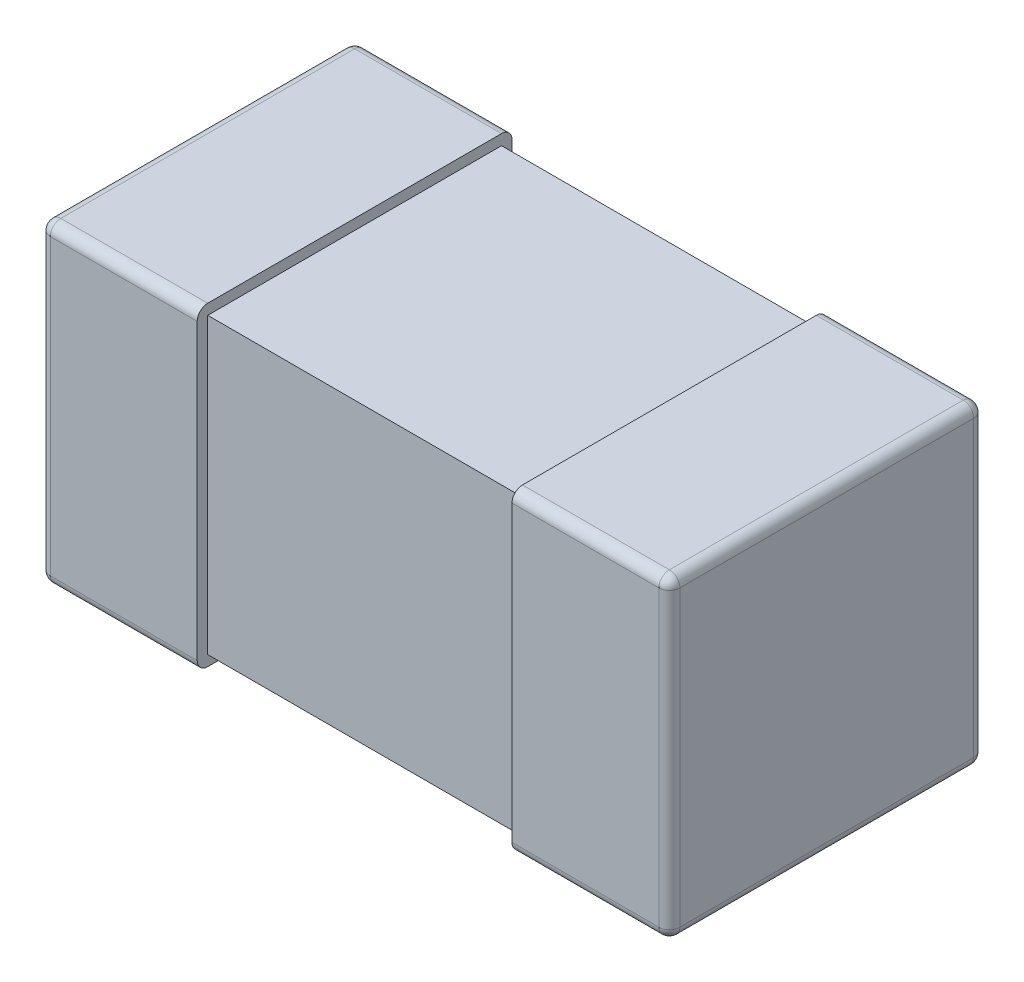
ISO-10303-21;
HEADER;
FILE_DESCRIPTION(('STEP AP214'),'2;1');
FILE_NAME('part.step','',(''),(''),'','','');
FILE_SCHEMA(('AUTOMOTIVE_DESIGN { 1 0 10303 214 1 1 1 1 }'));
ENDSEC;
DATA;
#1=APPLICATION_CONTEXT('core data for automotive mechanical design processes');
#2=APPLICATION_PROTOCOL_DEFINITION('international standard','automotive_design',2000,#1);
#3=PRODUCT_CONTEXT('',#1,'mechanical');
#4=PRODUCT('Part','Part','',(#3));
#5=PRODUCT_RELATED_PRODUCT_CATEGORY('part','',(#4));
#6=PRODUCT_DEFINITION_FORMATION('','',#4);
#7=PRODUCT_DEFINITION_CONTEXT('part definition',#1,'design');
#8=PRODUCT_DEFINITION('design','',#6,#7);
#9=PRODUCT_DEFINITION_SHAPE('','',#8);
#10=(LENGTH_UNIT() NAMED_UNIT(*) SI_UNIT(.MILLI.,.METRE.));
#11=(NAMED_UNIT(*) PLANE_ANGLE_UNIT() SI_UNIT($,.RADIAN.));
#12=(NAMED_UNIT(*) SI_UNIT($,.STERADIAN.) SOLID_ANGLE_UNIT());
#13=UNCERTAINTY_MEASURE_WITH_UNIT(LENGTH_MEASURE(1.E-05),#10,'distance_accuracy_value','');
#14=(GEOMETRIC_REPRESENTATION_CONTEXT(3) GLOBAL_UNCERTAINTY_ASSIGNED_CONTEXT((#13)) GLOBAL_UNIT_ASSIGNED_CONTEXT((#10,
#11,#12)) REPRESENTATION_CONTEXT('',''));
#15=CARTESIAN_POINT('',(0.,0.,0.));
#16=DIRECTION('',(0.,0.,1.));
#17=DIRECTION('',(1.,0.,0.));
#18=AXIS2_PLACEMENT_3D('',#15,#16,#17);
#19=CARTESIAN_POINT('',(-0.3,0.15,-0.15));
#20=DIRECTION('',(1.,0.,0.));
#21=DIRECTION('',(0.,0.,-1.));
#22=AXIS2_PLACEMENT_3D('',#19,#20,#21);
#23=PLANE('',#22);
#24=DIRECTION('',(0.,-1.,0.));
#25=VECTOR('',#24,1.);
#26=CARTESIAN_POINT('',(-0.3,0.15,-0.14));
#27=LINE('',#26,#25);
#28=CARTESIAN_POINT('',(-0.3,0.14,-0.14));
#29=VERTEX_POINT('',#28);
#30=CARTESIAN_POINT('',(-0.3,-0.14,-0.14));
#31=VERTEX_POINT('',#30);
#32=EDGE_CURVE('E349',#29,#31,#27,.T.);
#33=ORIENTED_EDGE('',*,*,#32,.T.);
#34=DIRECTION('',(0.,0.,1.));
#35=VECTOR('',#34,1.);
#36=CARTESIAN_POINT('',(-0.3,-0.14,-0.15));
#37=LINE('',#36,#35);
#38=CARTESIAN_POINT('',(-0.3,-0.14,0.14));
#39=VERTEX_POINT('',#38);
#40=EDGE_CURVE('E351',#31,#39,#37,.T.);
#41=ORIENTED_EDGE('',*,*,#40,.T.);
#42=DIRECTION('',(0.,-1.,0.));
#43=VECTOR('',#42,1.);
#44=CARTESIAN_POINT('',(-0.3,0.15,0.14));
#45=LINE('',#44,#43);
#46=CARTESIAN_POINT('',(-0.3,0.14,0.14));
#47=VERTEX_POINT('',#46);
#48=EDGE_CURVE('E347',#39,#47,#45,.F.);
#49=ORIENTED_EDGE('',*,*,#48,.T.);
#50=DIRECTION('',(0.,0.,1.));
#51=VECTOR('',#50,1.);
#52=CARTESIAN_POINT('',(-0.3,0.14,-0.15));
#53=LINE('',#52,#51);
#54=EDGE_CURVE('E345',#47,#29,#53,.F.);
#55=ORIENTED_EDGE('',*,*,#54,.T.);
#56=EDGE_LOOP('',(#33,#41,#49,#55));
#57=FACE_BOUND('',#56,.T.);
#58=ADVANCED_FACE('F34',(#57),#23,.F.);
#59=CARTESIAN_POINT('',(-0.3,0.15,0.15));
#60=DIRECTION('',(0.,0.,-1.));
#61=DIRECTION('',(-1.,0.,0.));
#62=AXIS2_PLACEMENT_3D('',#59,#60,#61);
#63=PLANE('',#62);
#64=DIRECTION('',(0.,-1.,0.));
#65=VECTOR('',#64,1.);
#66=CARTESIAN_POINT('',(-0.29,0.15,0.15));
#67=LINE('',#66,#65);
#68=CARTESIAN_POINT('',(-0.29,0.14,0.15));
#69=VERTEX_POINT('',#68);
#70=CARTESIAN_POINT('',(-0.29,-0.14,0.15));
#71=VERTEX_POINT('',#70);
#72=EDGE_CURVE('E377',#69,#71,#67,.T.);
#73=ORIENTED_EDGE('',*,*,#72,.T.);
#74=DIRECTION('',(1.,0.,0.));
#75=VECTOR('',#74,1.);
#76=CARTESIAN_POINT('',(-0.3,-0.14,0.15));
#77=LINE('',#76,#75);
#78=CARTESIAN_POINT('',(-0.15,-0.14,0.15));
#79=VERTEX_POINT('',#78);
#80=EDGE_CURVE('E379',#71,#79,#77,.T.);
#81=ORIENTED_EDGE('',*,*,#80,.T.);
#82=DIRECTION('',(0.,-1.,0.));
#83=VECTOR('',#82,1.);
#84=CARTESIAN_POINT('',(-0.15,0.15,0.15));
#85=LINE('',#84,#83);
#86=CARTESIAN_POINT('',(-0.15,0.14,0.15));
#87=VERTEX_POINT('',#86);
#88=EDGE_CURVE('E342',#87,#79,#85,.T.);
#89=ORIENTED_EDGE('',*,*,#88,.F.);
#90=DIRECTION('',(1.,0.,0.));
#91=VECTOR('',#90,1.);
#92=CARTESIAN_POINT('',(-0.3,0.14,0.15));
#93=LINE('',#92,#91);
#94=EDGE_CURVE('E375',#87,#69,#93,.F.);
#95=ORIENTED_EDGE('',*,*,#94,.T.);
#96=EDGE_LOOP('',(#73,#81,#89,#95));
#97=FACE_BOUND('',#96,.T.);
#98=ADVANCED_FACE('F448',(#97),#63,.F.);
#99=CARTESIAN_POINT('',(-0.15,0.15,-0.15));
#100=DIRECTION('',(-1.,0.,0.));
#101=DIRECTION('',(0.,0.,1.));
#102=AXIS2_PLACEMENT_3D('',#99,#100,#101);
#103=PLANE('',#102);
#104=DIRECTION('',(0.,1.,0.));
#105=VECTOR('',#104,1.);
#106=CARTESIAN_POINT('',(-0.15,0.14,-0.14));
#107=LINE('',#106,#105);
#108=CARTESIAN_POINT('',(-0.15,-0.14,-0.14));
#109=VERTEX_POINT('',#108);
#110=CARTESIAN_POINT('',(-0.15,0.14,-0.14));
#111=VERTEX_POINT('',#110);
#112=EDGE_CURVE('E208',#109,#111,#107,.T.);
#113=ORIENTED_EDGE('',*,*,#112,.F.);
#114=DIRECTION('',(0.,0.,-1.));
#115=VECTOR('',#114,1.);
#116=CARTESIAN_POINT('',(-0.15,-0.14,0.14));
#117=LINE('',#116,#115);
#118=CARTESIAN_POINT('',(-0.15,-0.14,0.14));
#119=VERTEX_POINT('',#118);
#120=EDGE_CURVE('E203',#119,#109,#117,.T.);
#121=ORIENTED_EDGE('',*,*,#120,.F.);
#122=DIRECTION('',(0.,-1.,0.));
#123=VECTOR('',#122,1.);
#124=CARTESIAN_POINT('',(-0.15,0.14,0.14));
#125=LINE('',#124,#123);
#126=CARTESIAN_POINT('',(-0.15,0.14,0.14));
#127=VERTEX_POINT('',#126);
#128=EDGE_CURVE('E324',#127,#119,#125,.T.);
#129=ORIENTED_EDGE('',*,*,#128,.F.);
#130=DIRECTION('',(0.,0.,1.));
#131=VECTOR('',#130,1.);
#132=CARTESIAN_POINT('',(-0.15,0.14,0.14));
#133=LINE('',#132,#131);
#134=EDGE_CURVE('E51',#111,#127,#133,.T.);
#135=ORIENTED_EDGE('',*,*,#134,.F.);
#136=EDGE_LOOP('',(#113,#121,#129,#135));
#137=FACE_BOUND('',#136,.T.);
#138=DIRECTION('',(0.,0.,-1.));
#139=VECTOR('',#138,1.);
#140=CARTESIAN_POINT('',(-0.15,-0.15,-0.15));
#141=LINE('',#140,#139);
#142=CARTESIAN_POINT('',(-0.15,-0.15,0.14));
#143=VERTEX_POINT('',#142);
#144=CARTESIAN_POINT('',(-0.15,-0.15,-0.14));
#145=VERTEX_POINT('',#144);
#146=EDGE_CURVE('E337',#143,#145,#141,.T.);
#147=ORIENTED_EDGE('',*,*,#146,.T.);
#148=CARTESIAN_POINT('',(-0.15,-0.14,-0.14));
#149=DIRECTION('',(-1.,0.,0.));
#150=DIRECTION('',(0.,0.,1.));
#151=AXIS2_PLACEMENT_3D('',#148,#149,#150);
#152=CIRCLE('',#151,0.01);
#153=CARTESIAN_POINT('',(-0.15,-0.14,-0.15));
#154=VERTEX_POINT('',#153);
#155=EDGE_CURVE('E373',#145,#154,#152,.F.);
#156=ORIENTED_EDGE('',*,*,#155,.T.);
#157=DIRECTION('',(0.,-1.,0.));
#158=VECTOR('',#157,1.);
#159=CARTESIAN_POINT('',(-0.15,0.15,-0.15));
#160=LINE('',#159,#158);
#161=CARTESIAN_POINT('',(-0.15,0.14,-0.15));
#162=VERTEX_POINT('',#161);
#163=EDGE_CURVE('E336',#162,#154,#160,.T.);
#164=ORIENTED_EDGE('',*,*,#163,.F.);
#165=CARTESIAN_POINT('',(-0.15,0.14,-0.14));
#166=DIRECTION('',(-1.,0.,0.));
#167=DIRECTION('',(0.,0.,1.));
#168=AXIS2_PLACEMENT_3D('',#165,#166,#167);
#169=CIRCLE('',#168,0.01);
#170=CARTESIAN_POINT('',(-0.15,0.15,-0.14));
#171=VERTEX_POINT('',#170);
#172=EDGE_CURVE('E369',#162,#171,#169,.F.);
#173=ORIENTED_EDGE('',*,*,#172,.T.);
#174=DIRECTION('',(0.,0.,-1.));
#175=VECTOR('',#174,1.);
#176=CARTESIAN_POINT('',(-0.15,0.15,-0.15));
#177=LINE('',#176,#175);
#178=CARTESIAN_POINT('',(-0.15,0.15,0.14));
#179=VERTEX_POINT('',#178);
#180=EDGE_CURVE('E334',#179,#171,#177,.T.);
#181=ORIENTED_EDGE('',*,*,#180,.F.);
#182=CARTESIAN_POINT('',(-0.15,0.14,0.14));
#183=DIRECTION('',(-1.,0.,0.));
#184=DIRECTION('',(0.,0.,1.));
#185=AXIS2_PLACEMENT_3D('',#182,#183,#184);
#186=CIRCLE('',#185,0.01);
#187=EDGE_CURVE('E367',#179,#87,#186,.F.);
#188=ORIENTED_EDGE('',*,*,#187,.T.);
#189=ORIENTED_EDGE('',*,*,#88,.T.);
#190=CARTESIAN_POINT('',(-0.15,-0.14,0.14));
#191=DIRECTION('',(-1.,0.,0.));
#192=DIRECTION('',(0.,0.,1.));
#193=AXIS2_PLACEMENT_3D('',#190,#191,#192);
#194=CIRCLE('',#193,0.01);
#195=EDGE_CURVE('E371',#79,#143,#194,.F.);
#196=ORIENTED_EDGE('',*,*,#195,.T.);
#197=EDGE_LOOP('',(#147,#156,#164,#173,#181,#188,#189,#196));
#198=FACE_BOUND('',#197,.T.);
#199=ADVANCED_FACE('F445',(#137,#198),#103,.F.);
#200=CARTESIAN_POINT('',(-0.3,0.15,-0.15));
#201=DIRECTION('',(0.,0.,1.));
#202=DIRECTION('',(1.,0.,0.));
#203=AXIS2_PLACEMENT_3D('',#200,#201,#202);
#204=PLANE('',#203);
#205=ORIENTED_EDGE('',*,*,#163,.T.);
#206=DIRECTION('',(-1.,0.,0.));
#207=VECTOR('',#206,1.);
#208=CARTESIAN_POINT('',(-0.3,-0.14,-0.15));
#209=LINE('',#208,#207);
#210=CARTESIAN_POINT('',(-0.29,-0.14,-0.15));
#211=VERTEX_POINT('',#210);
#212=EDGE_CURVE('E365',#154,#211,#209,.T.);
#213=ORIENTED_EDGE('',*,*,#212,.T.);
#214=DIRECTION('',(0.,-1.,0.));
#215=VECTOR('',#214,1.);
#216=CARTESIAN_POINT('',(-0.29,0.15,-0.15));
#217=LINE('',#216,#215);
#218=CARTESIAN_POINT('',(-0.29,0.14,-0.15));
#219=VERTEX_POINT('',#218);
#220=EDGE_CURVE('E363',#211,#219,#217,.F.);
#221=ORIENTED_EDGE('',*,*,#220,.T.);
#222=DIRECTION('',(-1.,0.,0.));
#223=VECTOR('',#222,1.);
#224=CARTESIAN_POINT('',(-0.15,0.14,-0.15));
#225=LINE('',#224,#223);
#226=EDGE_CURVE('E361',#219,#162,#225,.F.);
#227=ORIENTED_EDGE('',*,*,#226,.T.);
#228=EDGE_LOOP('',(#205,#213,#221,#227));
#229=FACE_BOUND('',#228,.T.);
#230=ADVANCED_FACE('F474',(#229),#204,.F.);
#231=CARTESIAN_POINT('',(-0.3,0.15,0.15));
#232=DIRECTION('',(0.,1.,0.));
#233=DIRECTION('',(0.,0.,1.));
#234=AXIS2_PLACEMENT_3D('',#231,#232,#233);
#235=PLANE('',#234);
#236=ORIENTED_EDGE('',*,*,#180,.T.);
#237=DIRECTION('',(-1.,0.,0.));
#238=VECTOR('',#237,1.);
#239=CARTESIAN_POINT('',(-0.3,0.15,-0.14));
#240=LINE('',#239,#238);
#241=CARTESIAN_POINT('',(-0.29,0.15,-0.14));
#242=VERTEX_POINT('',#241);
#243=EDGE_CURVE('E11',#171,#242,#240,.T.);
#244=ORIENTED_EDGE('',*,*,#243,.T.);
#245=DIRECTION('',(0.,0.,1.));
#246=VECTOR('',#245,1.);
#247=CARTESIAN_POINT('',(-0.29,0.15,0.15));
#248=LINE('',#247,#246);
#249=CARTESIAN_POINT('',(-0.29,0.15,0.14));
#250=VERTEX_POINT('',#249);
#251=EDGE_CURVE('E43',#242,#250,#248,.T.);
#252=ORIENTED_EDGE('',*,*,#251,.T.);
#253=DIRECTION('',(1.,0.,0.));
#254=VECTOR('',#253,1.);
#255=CARTESIAN_POINT('',(-0.15,0.15,0.14));
#256=LINE('',#255,#254);
#257=EDGE_CURVE('E381',#250,#179,#256,.T.);
#258=ORIENTED_EDGE('',*,*,#257,.T.);
#259=EDGE_LOOP('',(#236,#244,#252,#258));
#260=FACE_BOUND('',#259,.T.);
#261=ADVANCED_FACE('F435',(#260),#235,.T.);
#262=CARTESIAN_POINT('',(-0.3,-0.15,0.15));
#263=DIRECTION('',(0.,1.,0.));
#264=DIRECTION('',(0.,0.,1.));
#265=AXIS2_PLACEMENT_3D('',#262,#263,#264);
#266=PLANE('',#265);
#267=DIRECTION('',(0.,0.,1.));
#268=VECTOR('',#267,1.);
#269=CARTESIAN_POINT('',(-0.29,-0.15,0.15));
#270=LINE('',#269,#268);
#271=CARTESIAN_POINT('',(-0.29,-0.15,0.14));
#272=VERTEX_POINT('',#271);
#273=CARTESIAN_POINT('',(-0.29,-0.15,-0.14));
#274=VERTEX_POINT('',#273);
#275=EDGE_CURVE('E356',#272,#274,#270,.F.);
#276=ORIENTED_EDGE('',*,*,#275,.T.);
#277=DIRECTION('',(-1.,0.,0.));
#278=VECTOR('',#277,1.);
#279=CARTESIAN_POINT('',(-0.3,-0.15,-0.14));
#280=LINE('',#279,#278);
#281=EDGE_CURVE('E359',#274,#145,#280,.F.);
#282=ORIENTED_EDGE('',*,*,#281,.T.);
#283=ORIENTED_EDGE('',*,*,#146,.F.);
#284=DIRECTION('',(1.,0.,0.));
#285=VECTOR('',#284,1.);
#286=CARTESIAN_POINT('',(-0.3,-0.15,0.14));
#287=LINE('',#286,#285);
#288=EDGE_CURVE('E354',#143,#272,#287,.F.);
#289=ORIENTED_EDGE('',*,*,#288,.T.);
#290=EDGE_LOOP('',(#276,#282,#283,#289));
#291=FACE_BOUND('',#290,.T.);
#292=ADVANCED_FACE('F465',(#291),#266,.F.);
#293=CARTESIAN_POINT('',(-0.3,0.14,-0.14));
#294=DIRECTION('',(1.,0.,0.));
#295=DIRECTION('',(0.,0.,-1.));
#296=AXIS2_PLACEMENT_3D('',#293,#294,#295);
#297=CYLINDRICAL_SURFACE('',#296,0.01);
#298=ORIENTED_EDGE('',*,*,#172,.F.);
#299=ORIENTED_EDGE('',*,*,#226,.F.);
#300=CARTESIAN_POINT('',(-0.29,0.14,-0.14));
#301=DIRECTION('',(-1.,0.,0.));
#302=DIRECTION('',(0.,0.,1.));
#303=AXIS2_PLACEMENT_3D('',#300,#301,#302);
#304=CIRCLE('',#303,0.01);
#305=EDGE_CURVE('E38',#242,#219,#304,.T.);
#306=ORIENTED_EDGE('',*,*,#305,.F.);
#307=ORIENTED_EDGE('',*,*,#243,.F.);
#308=EDGE_LOOP('',(#298,#299,#306,#307));
#309=FACE_BOUND('',#308,.T.);
#310=ADVANCED_FACE('F36',(#309),#297,.T.);
#311=CARTESIAN_POINT('',(-0.29,0.14,0.15));
#312=DIRECTION('',(0.,0.,-1.));
#313=DIRECTION('',(-1.,0.,0.));
#314=AXIS2_PLACEMENT_3D('',#311,#312,#313);
#315=CYLINDRICAL_SURFACE('',#314,0.01);
#316=CARTESIAN_POINT('',(-0.29,0.14,0.14));
#317=DIRECTION('',(0.,0.,1.));
#318=DIRECTION('',(1.,0.,0.));
#319=AXIS2_PLACEMENT_3D('',#316,#317,#318);
#320=CIRCLE('',#319,0.01);
#321=EDGE_CURVE('E408',#250,#47,#320,.T.);
#322=ORIENTED_EDGE('',*,*,#321,.F.);
#323=ORIENTED_EDGE('',*,*,#251,.F.);
#324=CARTESIAN_POINT('',(-0.29,0.14,-0.14));
#325=DIRECTION('',(0.,0.,-1.));
#326=DIRECTION('',(0.,1.,0.));
#327=AXIS2_PLACEMENT_3D('',#324,#325,#326);
#328=CIRCLE('',#327,0.01);
#329=EDGE_CURVE('E410',#29,#242,#328,.T.);
#330=ORIENTED_EDGE('',*,*,#329,.F.);
#331=ORIENTED_EDGE('',*,*,#54,.F.);
#332=EDGE_LOOP('',(#322,#323,#330,#331));
#333=FACE_BOUND('',#332,.T.);
#334=ADVANCED_FACE('F433',(#333),#315,.T.);
#335=CARTESIAN_POINT('',(-0.3,0.14,0.14));
#336=DIRECTION('',(-1.,0.,0.));
#337=DIRECTION('',(0.,0.,1.));
#338=AXIS2_PLACEMENT_3D('',#335,#336,#337);
#339=CYLINDRICAL_SURFACE('',#338,0.01);
#340=ORIENTED_EDGE('',*,*,#187,.F.);
#341=ORIENTED_EDGE('',*,*,#257,.F.);
#342=CARTESIAN_POINT('',(-0.29,0.14,0.14));
#343=DIRECTION('',(-1.,0.,0.));
#344=DIRECTION('',(0.,0.,1.));
#345=AXIS2_PLACEMENT_3D('',#342,#343,#344);
#346=CIRCLE('',#345,0.01);
#347=EDGE_CURVE('E405',#69,#250,#346,.T.);
#348=ORIENTED_EDGE('',*,*,#347,.F.);
#349=ORIENTED_EDGE('',*,*,#94,.F.);
#350=EDGE_LOOP('',(#340,#341,#348,#349));
#351=FACE_BOUND('',#350,.T.);
#352=ADVANCED_FACE('F440',(#351),#339,.T.);
#353=CARTESIAN_POINT('',(-0.29,0.14,-0.14));
#354=DIRECTION('',(0.,0.,1.));
#355=DIRECTION('',(1.,0.,0.));
#356=AXIS2_PLACEMENT_3D('',#353,#354,#355);
#357=SPHERICAL_SURFACE('',#356,0.01);
#358=ORIENTED_EDGE('',*,*,#329,.T.);
#359=ORIENTED_EDGE('',*,*,#305,.T.);
#360=CARTESIAN_POINT('',(-0.29,0.14,-0.14));
#361=DIRECTION('',(0.,1.,0.));
#362=DIRECTION('',(0.,0.,1.));
#363=AXIS2_PLACEMENT_3D('',#360,#361,#362);
#364=CIRCLE('',#363,0.01);
#365=EDGE_CURVE('E402',#29,#219,#364,.F.);
#366=ORIENTED_EDGE('',*,*,#365,.F.);
#367=EDGE_LOOP('',(#358,#359,#366));
#368=FACE_BOUND('',#367,.T.);
#369=ADVANCED_FACE('F417',(#368),#357,.T.);
#370=CARTESIAN_POINT('',(-0.29,0.14,0.14));
#371=DIRECTION('',(0.,0.,1.));
#372=DIRECTION('',(1.,0.,0.));
#373=AXIS2_PLACEMENT_3D('',#370,#371,#372);
#374=SPHERICAL_SURFACE('',#373,0.01);
#375=ORIENTED_EDGE('',*,*,#347,.T.);
#376=ORIENTED_EDGE('',*,*,#321,.T.);
#377=CARTESIAN_POINT('',(-0.29,0.14,0.14));
#378=DIRECTION('',(0.,1.,0.));
#379=DIRECTION('',(0.,0.,1.));
#380=AXIS2_PLACEMENT_3D('',#377,#378,#379);
#381=CIRCLE('',#380,0.01);
#382=EDGE_CURVE('E399',#69,#47,#381,.F.);
#383=ORIENTED_EDGE('',*,*,#382,.F.);
#384=EDGE_LOOP('',(#375,#376,#383));
#385=FACE_BOUND('',#384,.T.);
#386=ADVANCED_FACE('F506',(#385),#374,.T.);
#387=CARTESIAN_POINT('',(-0.3,-0.14,-0.14));
#388=DIRECTION('',(-1.,0.,0.));
#389=DIRECTION('',(0.,0.,1.));
#390=AXIS2_PLACEMENT_3D('',#387,#388,#389);
#391=CYLINDRICAL_SURFACE('',#390,0.01);
#392=ORIENTED_EDGE('',*,*,#155,.F.);
#393=ORIENTED_EDGE('',*,*,#281,.F.);
#394=CARTESIAN_POINT('',(-0.29,-0.14,-0.14));
#395=DIRECTION('',(-1.,0.,0.));
#396=DIRECTION('',(0.,0.,1.));
#397=AXIS2_PLACEMENT_3D('',#394,#395,#396);
#398=CIRCLE('',#397,0.01);
#399=EDGE_CURVE('E396',#211,#274,#398,.T.);
#400=ORIENTED_EDGE('',*,*,#399,.F.);
#401=ORIENTED_EDGE('',*,*,#212,.F.);
#402=EDGE_LOOP('',(#392,#393,#400,#401));
#403=FACE_BOUND('',#402,.T.);
#404=ADVANCED_FACE('F472',(#403),#391,.T.);
#405=CARTESIAN_POINT('',(-0.29,0.15,-0.14));
#406=DIRECTION('',(0.,-1.,0.));
#407=DIRECTION('',(0.,0.,-1.));
#408=AXIS2_PLACEMENT_3D('',#405,#406,#407);
#409=CYLINDRICAL_SURFACE('',#408,0.01);
#410=ORIENTED_EDGE('',*,*,#365,.T.);
#411=ORIENTED_EDGE('',*,*,#220,.F.);
#412=CARTESIAN_POINT('',(-0.29,-0.14,-0.14));
#413=DIRECTION('',(0.,-1.,0.));
#414=DIRECTION('',(0.,0.,-1.));
#415=AXIS2_PLACEMENT_3D('',#412,#413,#414);
#416=CIRCLE('',#415,0.01);
#417=EDGE_CURVE('E393',#31,#211,#416,.T.);
#418=ORIENTED_EDGE('',*,*,#417,.F.);
#419=ORIENTED_EDGE('',*,*,#32,.F.);
#420=EDGE_LOOP('',(#410,#411,#418,#419));
#421=FACE_BOUND('',#420,.T.);
#422=ADVANCED_FACE('F423',(#421),#409,.T.);
#423=CARTESIAN_POINT('',(-0.29,0.15,0.14));
#424=DIRECTION('',(0.,-1.,0.));
#425=DIRECTION('',(0.,0.,-1.));
#426=AXIS2_PLACEMENT_3D('',#423,#424,#425);
#427=CYLINDRICAL_SURFACE('',#426,0.01);
#428=ORIENTED_EDGE('',*,*,#382,.T.);
#429=ORIENTED_EDGE('',*,*,#48,.F.);
#430=CARTESIAN_POINT('',(-0.29,-0.14,0.14));
#431=DIRECTION('',(0.,-1.,0.));
#432=DIRECTION('',(0.,0.,-1.));
#433=AXIS2_PLACEMENT_3D('',#430,#431,#432);
#434=CIRCLE('',#433,0.01);
#435=EDGE_CURVE('E390',#71,#39,#434,.T.);
#436=ORIENTED_EDGE('',*,*,#435,.F.);
#437=ORIENTED_EDGE('',*,*,#72,.F.);
#438=EDGE_LOOP('',(#428,#429,#436,#437));
#439=FACE_BOUND('',#438,.T.);
#440=ADVANCED_FACE('F458',(#439),#427,.T.);
#441=CARTESIAN_POINT('',(-0.3,-0.14,0.14));
#442=DIRECTION('',(1.,0.,0.));
#443=DIRECTION('',(0.,0.,-1.));
#444=AXIS2_PLACEMENT_3D('',#441,#442,#443);
#445=CYLINDRICAL_SURFACE('',#444,0.01);
#446=ORIENTED_EDGE('',*,*,#195,.F.);
#447=ORIENTED_EDGE('',*,*,#80,.F.);
#448=CARTESIAN_POINT('',(-0.29,-0.14,0.14));
#449=DIRECTION('',(-1.,0.,0.));
#450=DIRECTION('',(0.,0.,1.));
#451=AXIS2_PLACEMENT_3D('',#448,#449,#450);
#452=CIRCLE('',#451,0.01);
#453=EDGE_CURVE('E387',#272,#71,#452,.T.);
#454=ORIENTED_EDGE('',*,*,#453,.F.);
#455=ORIENTED_EDGE('',*,*,#288,.F.);
#456=EDGE_LOOP('',(#446,#447,#454,#455));
#457=FACE_BOUND('',#456,.T.);
#458=ADVANCED_FACE('F454',(#457),#445,.T.);
#459=CARTESIAN_POINT('',(-0.29,-0.14,-0.14));
#460=DIRECTION('',(0.,0.,1.));
#461=DIRECTION('',(1.,0.,0.));
#462=AXIS2_PLACEMENT_3D('',#459,#460,#461);
#463=SPHERICAL_SURFACE('',#462,0.01);
#464=ORIENTED_EDGE('',*,*,#417,.T.);
#465=ORIENTED_EDGE('',*,*,#399,.T.);
#466=CARTESIAN_POINT('',(-0.29,-0.14,-0.14));
#467=DIRECTION('',(0.,0.,-1.));
#468=DIRECTION('',(-1.,0.,0.));
#469=AXIS2_PLACEMENT_3D('',#466,#467,#468);
#470=CIRCLE('',#469,0.01);
#471=EDGE_CURVE('E385',#31,#274,#470,.F.);
#472=ORIENTED_EDGE('',*,*,#471,.F.);
#473=EDGE_LOOP('',(#464,#465,#472));
#474=FACE_BOUND('',#473,.T.);
#475=ADVANCED_FACE('F494',(#474),#463,.T.);
#476=CARTESIAN_POINT('',(-0.29,-0.14,0.14));
#477=DIRECTION('',(0.,0.,1.));
#478=DIRECTION('',(1.,0.,0.));
#479=AXIS2_PLACEMENT_3D('',#476,#477,#478);
#480=SPHERICAL_SURFACE('',#479,0.01);
#481=ORIENTED_EDGE('',*,*,#453,.T.);
#482=ORIENTED_EDGE('',*,*,#435,.T.);
#483=CARTESIAN_POINT('',(-0.29,-0.14,0.14));
#484=DIRECTION('',(0.,0.,1.));
#485=DIRECTION('',(1.,0.,0.));
#486=AXIS2_PLACEMENT_3D('',#483,#484,#485);
#487=CIRCLE('',#486,0.01);
#488=EDGE_CURVE('E333',#272,#39,#487,.F.);
#489=ORIENTED_EDGE('',*,*,#488,.F.);
#490=EDGE_LOOP('',(#481,#482,#489));
#491=FACE_BOUND('',#490,.T.);
#492=ADVANCED_FACE('F461',(#491),#480,.T.);
#493=CARTESIAN_POINT('',(-0.29,-0.14,-0.15));
#494=DIRECTION('',(0.,0.,1.));
#495=DIRECTION('',(1.,0.,0.));
#496=AXIS2_PLACEMENT_3D('',#493,#494,#495);
#497=CYLINDRICAL_SURFACE('',#496,0.01);
#498=ORIENTED_EDGE('',*,*,#471,.T.);
#499=ORIENTED_EDGE('',*,*,#275,.F.);
#500=ORIENTED_EDGE('',*,*,#488,.T.);
#501=ORIENTED_EDGE('',*,*,#40,.F.);
#502=EDGE_LOOP('',(#498,#499,#500,#501));
#503=FACE_BOUND('',#502,.T.);
#504=ADVANCED_FACE('F463',(#503),#497,.T.);
#505=CARTESIAN_POINT('',(-0.545979797464466,-0.14,0.14));
#506=DIRECTION('',(0.,-1.,0.));
#507=DIRECTION('',(0.,0.,-1.));
#508=AXIS2_PLACEMENT_3D('',#505,#506,#507);
#509=PLANE('',#508);
#510=DIRECTION('',(1.,0.,0.));
#511=VECTOR('',#510,1.);
#512=CARTESIAN_POINT('',(-0.545979797464466,-0.14,0.14));
#513=LINE('',#512,#511);
#514=CARTESIAN_POINT('',(0.15,-0.14,0.14));
#515=VERTEX_POINT('',#514);
#516=EDGE_CURVE('E326',#119,#515,#513,.T.);
#517=ORIENTED_EDGE('',*,*,#516,.F.);
#518=ORIENTED_EDGE('',*,*,#120,.T.);
#519=DIRECTION('',(1.,0.,0.));
#520=VECTOR('',#519,1.);
#521=CARTESIAN_POINT('',(-0.545979797464466,-0.14,-0.14));
#522=LINE('',#521,#520);
#523=CARTESIAN_POINT('',(0.15,-0.14,-0.14));
#524=VERTEX_POINT('',#523);
#525=EDGE_CURVE('E196',#109,#524,#522,.T.);
#526=ORIENTED_EDGE('',*,*,#525,.T.);
#527=DIRECTION('',(0.,0.,-1.));
#528=VECTOR('',#527,1.);
#529=CARTESIAN_POINT('',(0.15,-0.14,0.14));
#530=LINE('',#529,#528);
#531=EDGE_CURVE('E200',#515,#524,#530,.T.);
#532=ORIENTED_EDGE('',*,*,#531,.F.);
#533=EDGE_LOOP('',(#517,#518,#526,#532));
#534=FACE_BOUND('',#533,.T.);
#535=ADVANCED_FACE('F199',(#534),#509,.T.);
#536=CARTESIAN_POINT('',(-0.545979797464466,0.14,-0.14));
#537=DIRECTION('',(0.,0.,-1.));
#538=DIRECTION('',(0.,1.,0.));
#539=AXIS2_PLACEMENT_3D('',#536,#537,#538);
#540=PLANE('',#539);
#541=ORIENTED_EDGE('',*,*,#525,.F.);
#542=ORIENTED_EDGE('',*,*,#112,.T.);
#543=DIRECTION('',(1.,0.,0.));
#544=VECTOR('',#543,1.);
#545=CARTESIAN_POINT('',(-0.545979797464466,0.14,-0.14));
#546=LINE('',#545,#544);
#547=CARTESIAN_POINT('',(0.15,0.14,-0.14));
#548=VERTEX_POINT('',#547);
#549=EDGE_CURVE('E220',#111,#548,#546,.T.);
#550=ORIENTED_EDGE('',*,*,#549,.T.);
#551=DIRECTION('',(0.,1.,0.));
#552=VECTOR('',#551,1.);
#553=CARTESIAN_POINT('',(0.15,0.14,-0.14));
#554=LINE('',#553,#552);
#555=EDGE_CURVE('E215',#524,#548,#554,.T.);
#556=ORIENTED_EDGE('',*,*,#555,.F.);
#557=EDGE_LOOP('',(#541,#542,#550,#556));
#558=FACE_BOUND('',#557,.T.);
#559=ADVANCED_FACE('F219',(#558),#540,.T.);
#560=CARTESIAN_POINT('',(-0.545979797464466,0.14,0.14));
#561=DIRECTION('',(0.,1.,0.));
#562=DIRECTION('',(0.,0.,1.));
#563=AXIS2_PLACEMENT_3D('',#560,#561,#562);
#564=PLANE('',#563);
#565=ORIENTED_EDGE('',*,*,#549,.F.);
#566=ORIENTED_EDGE('',*,*,#134,.T.);
#567=DIRECTION('',(1.,0.,0.));
#568=VECTOR('',#567,1.);
#569=CARTESIAN_POINT('',(-0.545979797464466,0.14,0.14));
#570=LINE('',#569,#568);
#571=CARTESIAN_POINT('',(0.15,0.14,0.14));
#572=VERTEX_POINT('',#571);
#573=EDGE_CURVE('E327',#127,#572,#570,.T.);
#574=ORIENTED_EDGE('',*,*,#573,.T.);
#575=DIRECTION('',(0.,0.,1.));
#576=VECTOR('',#575,1.);
#577=CARTESIAN_POINT('',(0.15,0.14,0.14));
#578=LINE('',#577,#576);
#579=EDGE_CURVE('E222',#548,#572,#578,.T.);
#580=ORIENTED_EDGE('',*,*,#579,.F.);
#581=EDGE_LOOP('',(#565,#566,#574,#580));
#582=FACE_BOUND('',#581,.T.);
#583=ADVANCED_FACE('F566',(#582),#564,.T.);
#584=CARTESIAN_POINT('',(-0.545979797464466,0.14,0.14));
#585=DIRECTION('',(0.,0.,1.));
#586=DIRECTION('',(1.,0.,0.));
#587=AXIS2_PLACEMENT_3D('',#584,#585,#586);
#588=PLANE('',#587);
#589=ORIENTED_EDGE('',*,*,#573,.F.);
#590=ORIENTED_EDGE('',*,*,#128,.T.);
#591=ORIENTED_EDGE('',*,*,#516,.T.);
#592=DIRECTION('',(0.,-1.,0.));
#593=VECTOR('',#592,1.);
#594=CARTESIAN_POINT('',(0.15,0.14,0.14));
#595=LINE('',#594,#593);
#596=EDGE_CURVE('E217',#572,#515,#595,.T.);
#597=ORIENTED_EDGE('',*,*,#596,.F.);
#598=EDGE_LOOP('',(#589,#590,#591,#597));
#599=FACE_BOUND('',#598,.T.);
#600=ADVANCED_FACE('F573',(#599),#588,.T.);
#601=CARTESIAN_POINT('',(0.3,0.15,-0.15));
#602=DIRECTION('',(-1.,0.,0.));
#603=DIRECTION('',(0.,0.,-1.));
#604=AXIS2_PLACEMENT_3D('',#601,#602,#603);
#605=PLANE('',#604);
#606=DIRECTION('',(0.,-1.,0.));
#607=VECTOR('',#606,1.);
#608=CARTESIAN_POINT('',(0.3,0.15,-0.14));
#609=LINE('',#608,#607);
#610=CARTESIAN_POINT('',(0.3,0.14,-0.14));
#611=VERTEX_POINT('',#610);
#612=CARTESIAN_POINT('',(0.3,-0.14,-0.14));
#613=VERTEX_POINT('',#612);
#614=EDGE_CURVE('E246',#611,#613,#609,.T.);
#615=ORIENTED_EDGE('',*,*,#614,.F.);
#616=DIRECTION('',(0.,0.,1.));
#617=VECTOR('',#616,1.);
#618=CARTESIAN_POINT('',(0.3,0.14,-0.15));
#619=LINE('',#618,#617);
#620=CARTESIAN_POINT('',(0.3,0.14,0.14));
#621=VERTEX_POINT('',#620);
#622=EDGE_CURVE('E240',#621,#611,#619,.F.);
#623=ORIENTED_EDGE('',*,*,#622,.F.);
#624=DIRECTION('',(0.,-1.,0.));
#625=VECTOR('',#624,1.);
#626=CARTESIAN_POINT('',(0.3,0.15,0.14));
#627=LINE('',#626,#625);
#628=CARTESIAN_POINT('',(0.3,-0.14,0.14));
#629=VERTEX_POINT('',#628);
#630=EDGE_CURVE('E243',#629,#621,#627,.F.);
#631=ORIENTED_EDGE('',*,*,#630,.F.);
#632=DIRECTION('',(0.,0.,1.));
#633=VECTOR('',#632,1.);
#634=CARTESIAN_POINT('',(0.3,-0.14,-0.15));
#635=LINE('',#634,#633);
#636=EDGE_CURVE('E249',#613,#629,#635,.T.);
#637=ORIENTED_EDGE('',*,*,#636,.F.);
#638=EDGE_LOOP('',(#615,#623,#631,#637));
#639=FACE_BOUND('',#638,.T.);
#640=ADVANCED_FACE('F580',(#639),#605,.F.);
#641=CARTESIAN_POINT('',(0.3,0.15,0.15));
#642=DIRECTION('',(0.,0.,-1.));
#643=DIRECTION('',(1.,0.,0.));
#644=AXIS2_PLACEMENT_3D('',#641,#642,#643);
#645=PLANE('',#644);
#646=DIRECTION('',(0.,-1.,0.));
#647=VECTOR('',#646,1.);
#648=CARTESIAN_POINT('',(0.29,0.15,0.15));
#649=LINE('',#648,#647);
#650=CARTESIAN_POINT('',(0.29,0.14,0.15));
#651=VERTEX_POINT('',#650);
#652=CARTESIAN_POINT('',(0.29,-0.14,0.15));
#653=VERTEX_POINT('',#652);
#654=EDGE_CURVE('E282',#651,#653,#649,.T.);
#655=ORIENTED_EDGE('',*,*,#654,.F.);
#656=DIRECTION('',(-1.,0.,0.));
#657=VECTOR('',#656,1.);
#658=CARTESIAN_POINT('',(0.3,0.14,0.15));
#659=LINE('',#658,#657);
#660=CARTESIAN_POINT('',(0.15,0.14,0.15));
#661=VERTEX_POINT('',#660);
#662=EDGE_CURVE('E279',#661,#651,#659,.F.);
#663=ORIENTED_EDGE('',*,*,#662,.F.);
#664=DIRECTION('',(0.,-1.,0.));
#665=VECTOR('',#664,1.);
#666=CARTESIAN_POINT('',(0.15,0.15,0.15));
#667=LINE('',#666,#665);
#668=CARTESIAN_POINT('',(0.15,-0.14,0.15));
#669=VERTEX_POINT('',#668);
#670=EDGE_CURVE('E237',#661,#669,#667,.T.);
#671=ORIENTED_EDGE('',*,*,#670,.T.);
#672=DIRECTION('',(-1.,0.,0.));
#673=VECTOR('',#672,1.);
#674=CARTESIAN_POINT('',(0.3,-0.14,0.15));
#675=LINE('',#674,#673);
#676=EDGE_CURVE('E285',#653,#669,#675,.T.);
#677=ORIENTED_EDGE('',*,*,#676,.F.);
#678=EDGE_LOOP('',(#655,#663,#671,#677));
#679=FACE_BOUND('',#678,.T.);
#680=ADVANCED_FACE('F589',(#679),#645,.F.);
#681=CARTESIAN_POINT('',(0.15,0.15,-0.15));
#682=DIRECTION('',(1.,0.,0.));
#683=DIRECTION('',(0.,0.,1.));
#684=AXIS2_PLACEMENT_3D('',#681,#682,#683);
#685=PLANE('',#684);
#686=ORIENTED_EDGE('',*,*,#555,.T.);
#687=ORIENTED_EDGE('',*,*,#579,.T.);
#688=ORIENTED_EDGE('',*,*,#596,.T.);
#689=ORIENTED_EDGE('',*,*,#531,.T.);
#690=EDGE_LOOP('',(#686,#687,#688,#689));
#691=FACE_BOUND('',#690,.T.);
#692=DIRECTION('',(0.,0.,-1.));
#693=VECTOR('',#692,1.);
#694=CARTESIAN_POINT('',(0.15,-0.15,-0.15));
#695=LINE('',#694,#693);
#696=CARTESIAN_POINT('',(0.15,-0.15,0.14));
#697=VERTEX_POINT('',#696);
#698=CARTESIAN_POINT('',(0.15,-0.15,-0.14));
#699=VERTEX_POINT('',#698);
#700=EDGE_CURVE('E231',#697,#699,#695,.T.);
#701=ORIENTED_EDGE('',*,*,#700,.F.);
#702=CARTESIAN_POINT('',(0.15,-0.14,0.14));
#703=DIRECTION('',(-1.,0.,0.));
#704=DIRECTION('',(0.,0.,1.));
#705=AXIS2_PLACEMENT_3D('',#702,#703,#704);
#706=CIRCLE('',#705,0.01);
#707=EDGE_CURVE('E273',#669,#697,#706,.F.);
#708=ORIENTED_EDGE('',*,*,#707,.F.);
#709=ORIENTED_EDGE('',*,*,#670,.F.);
#710=CARTESIAN_POINT('',(0.15,0.14,0.14));
#711=DIRECTION('',(-1.,0.,0.));
#712=DIRECTION('',(0.,0.,1.));
#713=AXIS2_PLACEMENT_3D('',#710,#711,#712);
#714=CIRCLE('',#713,0.01);
#715=CARTESIAN_POINT('',(0.15,0.15,0.14));
#716=VERTEX_POINT('',#715);
#717=EDGE_CURVE('E268',#716,#661,#714,.F.);
#718=ORIENTED_EDGE('',*,*,#717,.F.);
#719=DIRECTION('',(0.,0.,-1.));
#720=VECTOR('',#719,1.);
#721=CARTESIAN_POINT('',(0.15,0.15,-0.15));
#722=LINE('',#721,#720);
#723=CARTESIAN_POINT('',(0.15,0.15,-0.14));
#724=VERTEX_POINT('',#723);
#725=EDGE_CURVE('E227',#716,#724,#722,.T.);
#726=ORIENTED_EDGE('',*,*,#725,.T.);
#727=CARTESIAN_POINT('',(0.15,0.14,-0.14));
#728=DIRECTION('',(-1.,0.,0.));
#729=DIRECTION('',(0.,0.,1.));
#730=AXIS2_PLACEMENT_3D('',#727,#728,#729);
#731=CIRCLE('',#730,0.01);
#732=CARTESIAN_POINT('',(0.15,0.14,-0.15));
#733=VERTEX_POINT('',#732);
#734=EDGE_CURVE('E270',#733,#724,#731,.F.);
#735=ORIENTED_EDGE('',*,*,#734,.F.);
#736=DIRECTION('',(0.,-1.,0.));
#737=VECTOR('',#736,1.);
#738=CARTESIAN_POINT('',(0.15,0.15,-0.15));
#739=LINE('',#738,#737);
#740=CARTESIAN_POINT('',(0.15,-0.14,-0.15));
#741=VERTEX_POINT('',#740);
#742=EDGE_CURVE('E230',#733,#741,#739,.T.);
#743=ORIENTED_EDGE('',*,*,#742,.T.);
#744=CARTESIAN_POINT('',(0.15,-0.14,-0.14));
#745=DIRECTION('',(-1.,0.,0.));
#746=DIRECTION('',(0.,0.,1.));
#747=AXIS2_PLACEMENT_3D('',#744,#745,#746);
#748=CIRCLE('',#747,0.01);
#749=EDGE_CURVE('E276',#699,#741,#748,.F.);
#750=ORIENTED_EDGE('',*,*,#749,.F.);
#751=EDGE_LOOP('',(#701,#708,#709,#718,#726,#735,#743,#750));
#752=FACE_BOUND('',#751,.T.);
#753=ADVANCED_FACE('F212',(#691,#752),#685,.F.);
#754=CARTESIAN_POINT('',(0.3,0.15,-0.15));
#755=DIRECTION('',(0.,0.,1.));
#756=DIRECTION('',(-1.,0.,0.));
#757=AXIS2_PLACEMENT_3D('',#754,#755,#756);
#758=PLANE('',#757);
#759=ORIENTED_EDGE('',*,*,#742,.F.);
#760=DIRECTION('',(1.,0.,0.));
#761=VECTOR('',#760,1.);
#762=CARTESIAN_POINT('',(0.15,0.14,-0.15));
#763=LINE('',#762,#761);
#764=CARTESIAN_POINT('',(0.29,0.14,-0.15));
#765=VERTEX_POINT('',#764);
#766=EDGE_CURVE('E260',#765,#733,#763,.F.);
#767=ORIENTED_EDGE('',*,*,#766,.F.);
#768=DIRECTION('',(0.,-1.,0.));
#769=VECTOR('',#768,1.);
#770=CARTESIAN_POINT('',(0.29,0.15,-0.15));
#771=LINE('',#770,#769);
#772=CARTESIAN_POINT('',(0.29,-0.14,-0.15));
#773=VERTEX_POINT('',#772);
#774=EDGE_CURVE('E262',#773,#765,#771,.F.);
#775=ORIENTED_EDGE('',*,*,#774,.F.);
#776=DIRECTION('',(1.,0.,0.));
#777=VECTOR('',#776,1.);
#778=CARTESIAN_POINT('',(0.3,-0.14,-0.15));
#779=LINE('',#778,#777);
#780=EDGE_CURVE('E265',#741,#773,#779,.T.);
#781=ORIENTED_EDGE('',*,*,#780,.F.);
#782=EDGE_LOOP('',(#759,#767,#775,#781));
#783=FACE_BOUND('',#782,.T.);
#784=ADVANCED_FACE('F603',(#783),#758,.F.);
#785=CARTESIAN_POINT('',(0.3,0.15,0.15));
#786=DIRECTION('',(0.,1.,0.));
#787=DIRECTION('',(0.,0.,1.));
#788=AXIS2_PLACEMENT_3D('',#785,#786,#787);
#789=PLANE('',#788);
#790=ORIENTED_EDGE('',*,*,#725,.F.);
#791=DIRECTION('',(-1.,0.,0.));
#792=VECTOR('',#791,1.);
#793=CARTESIAN_POINT('',(0.15,0.15,0.14));
#794=LINE('',#793,#792);
#795=CARTESIAN_POINT('',(0.29,0.15,0.14));
#796=VERTEX_POINT('',#795);
#797=EDGE_CURVE('E288',#796,#716,#794,.T.);
#798=ORIENTED_EDGE('',*,*,#797,.F.);
#799=DIRECTION('',(0.,0.,1.));
#800=VECTOR('',#799,1.);
#801=CARTESIAN_POINT('',(0.29,0.15,0.15));
#802=LINE('',#801,#800);
#803=CARTESIAN_POINT('',(0.29,0.15,-0.14));
#804=VERTEX_POINT('',#803);
#805=EDGE_CURVE('E290',#804,#796,#802,.T.);
#806=ORIENTED_EDGE('',*,*,#805,.F.);
#807=DIRECTION('',(1.,0.,0.));
#808=VECTOR('',#807,1.);
#809=CARTESIAN_POINT('',(0.3,0.15,-0.14));
#810=LINE('',#809,#808);
#811=EDGE_CURVE('E293',#724,#804,#810,.T.);
#812=ORIENTED_EDGE('',*,*,#811,.F.);
#813=EDGE_LOOP('',(#790,#798,#806,#812));
#814=FACE_BOUND('',#813,.T.);
#815=ADVANCED_FACE('F610',(#814),#789,.T.);
#816=CARTESIAN_POINT('',(0.3,-0.15,0.15));
#817=DIRECTION('',(0.,1.,0.));
#818=DIRECTION('',(0.,0.,1.));
#819=AXIS2_PLACEMENT_3D('',#816,#817,#818);
#820=PLANE('',#819);
#821=DIRECTION('',(0.,0.,1.));
#822=VECTOR('',#821,1.);
#823=CARTESIAN_POINT('',(0.29,-0.15,0.15));
#824=LINE('',#823,#822);
#825=CARTESIAN_POINT('',(0.29,-0.15,0.14));
#826=VERTEX_POINT('',#825);
#827=CARTESIAN_POINT('',(0.29,-0.15,-0.14));
#828=VERTEX_POINT('',#827);
#829=EDGE_CURVE('E255',#826,#828,#824,.F.);
#830=ORIENTED_EDGE('',*,*,#829,.F.);
#831=DIRECTION('',(-1.,0.,0.));
#832=VECTOR('',#831,1.);
#833=CARTESIAN_POINT('',(0.3,-0.15,0.14));
#834=LINE('',#833,#832);
#835=EDGE_CURVE('E252',#697,#826,#834,.F.);
#836=ORIENTED_EDGE('',*,*,#835,.F.);
#837=ORIENTED_EDGE('',*,*,#700,.T.);
#838=DIRECTION('',(1.,0.,0.));
#839=VECTOR('',#838,1.);
#840=CARTESIAN_POINT('',(0.3,-0.15,-0.14));
#841=LINE('',#840,#839);
#842=EDGE_CURVE('E258',#828,#699,#841,.F.);
#843=ORIENTED_EDGE('',*,*,#842,.F.);
#844=EDGE_LOOP('',(#830,#836,#837,#843));
#845=FACE_BOUND('',#844,.T.);
#846=ADVANCED_FACE('F618',(#845),#820,.F.);
#847=CARTESIAN_POINT('',(0.3,0.14,-0.14));
#848=DIRECTION('',(-1.,0.,0.));
#849=DIRECTION('',(0.,0.,-1.));
#850=AXIS2_PLACEMENT_3D('',#847,#848,#849);
#851=CYLINDRICAL_SURFACE('',#850,0.01);
#852=ORIENTED_EDGE('',*,*,#734,.T.);
#853=ORIENTED_EDGE('',*,*,#811,.T.);
#854=CARTESIAN_POINT('',(0.29,0.14,-0.14));
#855=DIRECTION('',(-1.,0.,0.));
#856=DIRECTION('',(0.,0.,1.));
#857=AXIS2_PLACEMENT_3D('',#854,#855,#856);
#858=CIRCLE('',#857,0.01);
#859=EDGE_CURVE('E234',#804,#765,#858,.T.);
#860=ORIENTED_EDGE('',*,*,#859,.T.);
#861=ORIENTED_EDGE('',*,*,#766,.T.);
#862=EDGE_LOOP('',(#852,#853,#860,#861));
#863=FACE_BOUND('',#862,.T.);
#864=ADVANCED_FACE('F626',(#863),#851,.T.);
#865=CARTESIAN_POINT('',(0.29,0.14,0.15));
#866=DIRECTION('',(0.,0.,-1.));
#867=DIRECTION('',(1.,0.,0.));
#868=AXIS2_PLACEMENT_3D('',#865,#866,#867);
#869=CYLINDRICAL_SURFACE('',#868,0.01);
#870=CARTESIAN_POINT('',(0.29,0.14,0.14));
#871=DIRECTION('',(0.,0.,-1.));
#872=DIRECTION('',(-1.,0.,0.));
#873=AXIS2_PLACEMENT_3D('',#870,#871,#872);
#874=CIRCLE('',#873,0.01);
#875=EDGE_CURVE('E316',#796,#621,#874,.T.);
#876=ORIENTED_EDGE('',*,*,#875,.T.);
#877=ORIENTED_EDGE('',*,*,#622,.T.);
#878=CARTESIAN_POINT('',(0.29,0.14,-0.14));
#879=DIRECTION('',(0.,0.,1.));
#880=DIRECTION('',(0.,1.,0.));
#881=AXIS2_PLACEMENT_3D('',#878,#879,#880);
#882=CIRCLE('',#881,0.01);
#883=EDGE_CURVE('E319',#611,#804,#882,.T.);
#884=ORIENTED_EDGE('',*,*,#883,.T.);
#885=ORIENTED_EDGE('',*,*,#805,.T.);
#886=EDGE_LOOP('',(#876,#877,#884,#885));
#887=FACE_BOUND('',#886,.T.);
#888=ADVANCED_FACE('F634',(#887),#869,.T.);
#889=CARTESIAN_POINT('',(0.3,0.14,0.14));
#890=DIRECTION('',(1.,0.,0.));
#891=DIRECTION('',(0.,0.,1.));
#892=AXIS2_PLACEMENT_3D('',#889,#890,#891);
#893=CYLINDRICAL_SURFACE('',#892,0.01);
#894=ORIENTED_EDGE('',*,*,#717,.T.);
#895=ORIENTED_EDGE('',*,*,#662,.T.);
#896=CARTESIAN_POINT('',(0.29,0.14,0.14));
#897=DIRECTION('',(-1.,0.,0.));
#898=DIRECTION('',(0.,0.,1.));
#899=AXIS2_PLACEMENT_3D('',#896,#897,#898);
#900=CIRCLE('',#899,0.01);
#901=EDGE_CURVE('E314',#651,#796,#900,.T.);
#902=ORIENTED_EDGE('',*,*,#901,.T.);
#903=ORIENTED_EDGE('',*,*,#797,.T.);
#904=EDGE_LOOP('',(#894,#895,#902,#903));
#905=FACE_BOUND('',#904,.T.);
#906=ADVANCED_FACE('F642',(#905),#893,.T.);
#907=CARTESIAN_POINT('',(0.29,0.14,-0.14));
#908=DIRECTION('',(0.,0.,1.));
#909=DIRECTION('',(-1.,0.,0.));
#910=AXIS2_PLACEMENT_3D('',#907,#908,#909);
#911=SPHERICAL_SURFACE('',#910,0.01);
#912=ORIENTED_EDGE('',*,*,#883,.F.);
#913=CARTESIAN_POINT('',(0.29,0.14,-0.14));
#914=DIRECTION('',(0.,-1.,0.));
#915=DIRECTION('',(0.,0.,1.));
#916=AXIS2_PLACEMENT_3D('',#913,#914,#915);
#917=CIRCLE('',#916,0.01);
#918=EDGE_CURVE('E312',#611,#765,#917,.F.);
#919=ORIENTED_EDGE('',*,*,#918,.T.);
#920=ORIENTED_EDGE('',*,*,#859,.F.);
#921=EDGE_LOOP('',(#912,#919,#920));
#922=FACE_BOUND('',#921,.T.);
#923=ADVANCED_FACE('F650',(#922),#911,.T.);
#924=CARTESIAN_POINT('',(0.29,0.14,0.14));
#925=DIRECTION('',(0.,0.,1.));
#926=DIRECTION('',(-1.,0.,0.));
#927=AXIS2_PLACEMENT_3D('',#924,#925,#926);
#928=SPHERICAL_SURFACE('',#927,0.01);
#929=ORIENTED_EDGE('',*,*,#901,.F.);
#930=CARTESIAN_POINT('',(0.29,0.14,0.14));
#931=DIRECTION('',(0.,-1.,0.));
#932=DIRECTION('',(0.,0.,1.));
#933=AXIS2_PLACEMENT_3D('',#930,#931,#932);
#934=CIRCLE('',#933,0.01);
#935=EDGE_CURVE('E310',#651,#621,#934,.F.);
#936=ORIENTED_EDGE('',*,*,#935,.T.);
#937=ORIENTED_EDGE('',*,*,#875,.F.);
#938=EDGE_LOOP('',(#929,#936,#937));
#939=FACE_BOUND('',#938,.T.);
#940=ADVANCED_FACE('F659',(#939),#928,.T.);
#941=CARTESIAN_POINT('',(0.3,-0.14,-0.14));
#942=DIRECTION('',(1.,0.,0.));
#943=DIRECTION('',(0.,0.,1.));
#944=AXIS2_PLACEMENT_3D('',#941,#942,#943);
#945=CYLINDRICAL_SURFACE('',#944,0.01);
#946=ORIENTED_EDGE('',*,*,#749,.T.);
#947=ORIENTED_EDGE('',*,*,#780,.T.);
#948=CARTESIAN_POINT('',(0.29,-0.14,-0.14));
#949=DIRECTION('',(-1.,0.,0.));
#950=DIRECTION('',(0.,0.,1.));
#951=AXIS2_PLACEMENT_3D('',#948,#949,#950);
#952=CIRCLE('',#951,0.01);
#953=EDGE_CURVE('E307',#773,#828,#952,.T.);
#954=ORIENTED_EDGE('',*,*,#953,.T.);
#955=ORIENTED_EDGE('',*,*,#842,.T.);
#956=EDGE_LOOP('',(#946,#947,#954,#955));
#957=FACE_BOUND('',#956,.T.);
#958=ADVANCED_FACE('F668',(#957),#945,.T.);
#959=CARTESIAN_POINT('',(0.29,0.15,-0.14));
#960=DIRECTION('',(0.,-1.,0.));
#961=DIRECTION('',(0.,0.,-1.));
#962=AXIS2_PLACEMENT_3D('',#959,#960,#961);
#963=CYLINDRICAL_SURFACE('',#962,0.01);
#964=ORIENTED_EDGE('',*,*,#918,.F.);
#965=ORIENTED_EDGE('',*,*,#614,.T.);
#966=CARTESIAN_POINT('',(0.29,-0.14,-0.14));
#967=DIRECTION('',(0.,1.,0.));
#968=DIRECTION('',(0.,0.,-1.));
#969=AXIS2_PLACEMENT_3D('',#966,#967,#968);
#970=CIRCLE('',#969,0.01);
#971=EDGE_CURVE('E305',#613,#773,#970,.T.);
#972=ORIENTED_EDGE('',*,*,#971,.T.);
#973=ORIENTED_EDGE('',*,*,#774,.T.);
#974=EDGE_LOOP('',(#964,#965,#972,#973));
#975=FACE_BOUND('',#974,.T.);
#976=ADVANCED_FACE('F676',(#975),#963,.T.);
#977=CARTESIAN_POINT('',(0.29,0.15,0.14));
#978=DIRECTION('',(0.,-1.,0.));
#979=DIRECTION('',(0.,0.,-1.));
#980=AXIS2_PLACEMENT_3D('',#977,#978,#979);
#981=CYLINDRICAL_SURFACE('',#980,0.01);
#982=ORIENTED_EDGE('',*,*,#935,.F.);
#983=ORIENTED_EDGE('',*,*,#654,.T.);
#984=CARTESIAN_POINT('',(0.29,-0.14,0.14));
#985=DIRECTION('',(0.,1.,0.));
#986=DIRECTION('',(0.,0.,-1.));
#987=AXIS2_PLACEMENT_3D('',#984,#985,#986);
#988=CIRCLE('',#987,0.01);
#989=EDGE_CURVE('E302',#653,#629,#988,.T.);
#990=ORIENTED_EDGE('',*,*,#989,.T.);
#991=ORIENTED_EDGE('',*,*,#630,.T.);
#992=EDGE_LOOP('',(#982,#983,#990,#991));
#993=FACE_BOUND('',#992,.T.);
#994=ADVANCED_FACE('F684',(#993),#981,.T.);
#995=CARTESIAN_POINT('',(0.3,-0.14,0.14));
#996=DIRECTION('',(-1.,0.,0.));
#997=DIRECTION('',(0.,0.,-1.));
#998=AXIS2_PLACEMENT_3D('',#995,#996,#997);
#999=CYLINDRICAL_SURFACE('',#998,0.01);
#1000=ORIENTED_EDGE('',*,*,#707,.T.);
#1001=ORIENTED_EDGE('',*,*,#835,.T.);
#1002=CARTESIAN_POINT('',(0.29,-0.14,0.14));
#1003=DIRECTION('',(-1.,0.,0.));
#1004=DIRECTION('',(0.,0.,1.));
#1005=AXIS2_PLACEMENT_3D('',#1002,#1003,#1004);
#1006=CIRCLE('',#1005,0.01);
#1007=EDGE_CURVE('E300',#826,#653,#1006,.T.);
#1008=ORIENTED_EDGE('',*,*,#1007,.T.);
#1009=ORIENTED_EDGE('',*,*,#676,.T.);
#1010=EDGE_LOOP('',(#1000,#1001,#1008,#1009));
#1011=FACE_BOUND('',#1010,.T.);
#1012=ADVANCED_FACE('F692',(#1011),#999,.T.);
#1013=CARTESIAN_POINT('',(0.29,-0.14,-0.14));
#1014=DIRECTION('',(0.,0.,1.));
#1015=DIRECTION('',(-1.,0.,0.));
#1016=AXIS2_PLACEMENT_3D('',#1013,#1014,#1015);
#1017=SPHERICAL_SURFACE('',#1016,0.01);
#1018=ORIENTED_EDGE('',*,*,#971,.F.);
#1019=CARTESIAN_POINT('',(0.29,-0.14,-0.14));
#1020=DIRECTION('',(0.,0.,1.));
#1021=DIRECTION('',(1.,0.,0.));
#1022=AXIS2_PLACEMENT_3D('',#1019,#1020,#1021);
#1023=CIRCLE('',#1022,0.01);
#1024=EDGE_CURVE('E298',#613,#828,#1023,.F.);
#1025=ORIENTED_EDGE('',*,*,#1024,.T.);
#1026=ORIENTED_EDGE('',*,*,#953,.F.);
#1027=EDGE_LOOP('',(#1018,#1025,#1026));
#1028=FACE_BOUND('',#1027,.T.);
#1029=ADVANCED_FACE('F700',(#1028),#1017,.T.);
#1030=CARTESIAN_POINT('',(0.29,-0.14,0.14));
#1031=DIRECTION('',(0.,0.,1.));
#1032=DIRECTION('',(-1.,0.,0.));
#1033=AXIS2_PLACEMENT_3D('',#1030,#1031,#1032);
#1034=SPHERICAL_SURFACE('',#1033,0.01);
#1035=ORIENTED_EDGE('',*,*,#1007,.F.);
#1036=CARTESIAN_POINT('',(0.29,-0.14,0.14));
#1037=DIRECTION('',(0.,0.,-1.));
#1038=DIRECTION('',(-1.,0.,0.));
#1039=AXIS2_PLACEMENT_3D('',#1036,#1037,#1038);
#1040=CIRCLE('',#1039,0.01);
#1041=EDGE_CURVE('E296',#826,#629,#1040,.F.);
#1042=ORIENTED_EDGE('',*,*,#1041,.T.);
#1043=ORIENTED_EDGE('',*,*,#989,.F.);
#1044=EDGE_LOOP('',(#1035,#1042,#1043));
#1045=FACE_BOUND('',#1044,.T.);
#1046=ADVANCED_FACE('F707',(#1045),#1034,.T.);
#1047=CARTESIAN_POINT('',(0.29,-0.14,-0.15));
#1048=DIRECTION('',(0.,0.,1.));
#1049=DIRECTION('',(-1.,0.,0.));
#1050=AXIS2_PLACEMENT_3D('',#1047,#1048,#1049);
#1051=CYLINDRICAL_SURFACE('',#1050,0.01);
#1052=ORIENTED_EDGE('',*,*,#1024,.F.);
#1053=ORIENTED_EDGE('',*,*,#636,.T.);
#1054=ORIENTED_EDGE('',*,*,#1041,.F.);
#1055=ORIENTED_EDGE('',*,*,#829,.T.);
#1056=EDGE_LOOP('',(#1052,#1053,#1054,#1055));
#1057=FACE_BOUND('',#1056,.T.);
#1058=ADVANCED_FACE('F715',(#1057),#1051,.T.);
#1059=CLOSED_SHELL('',(#58,#98,#199,#230,#261,#292,#310,#334,#352,#369,#386,#404,#422,#440,#458,
#475,#492,#504,#535,#559,#583,#600,#640,#680,#753,#784,#815,#846,#864,#888,#906,#923,#940,#958,
#976,#994,#1012,#1029,#1046,#1058));
#1060=MANIFOLD_SOLID_BREP('B2',#1059);
#1061=ADVANCED_BREP_SHAPE_REPRESENTATION('',(#18,#1060),#14);
#1062=SHAPE_DEFINITION_REPRESENTATION(#9,#1061);
ENDSEC;
END-ISO-10303-21;
